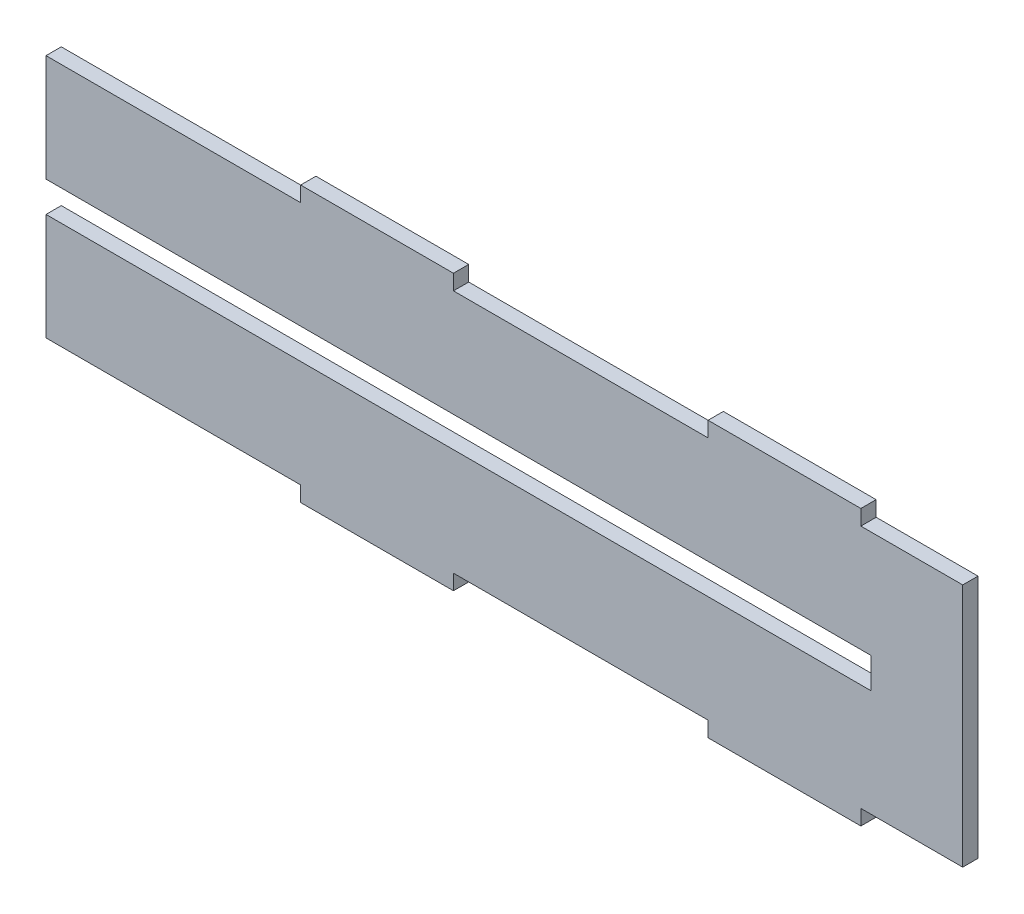
ISO-10303-21;
HEADER;
FILE_DESCRIPTION(('STEP AP214'),'2;1');
FILE_NAME('part.step','',(''),(''),'','','');
FILE_SCHEMA(('AUTOMOTIVE_DESIGN { 1 0 10303 214 1 1 1 1 }'));
ENDSEC;
DATA;
#1=APPLICATION_CONTEXT('core data for automotive mechanical design processes');
#2=APPLICATION_PROTOCOL_DEFINITION('international standard','automotive_design',2000,#1);
#3=PRODUCT_CONTEXT('',#1,'mechanical');
#4=PRODUCT('Part','Part','',(#3));
#5=PRODUCT_RELATED_PRODUCT_CATEGORY('part','',(#4));
#6=PRODUCT_DEFINITION_FORMATION('','',#4);
#7=PRODUCT_DEFINITION_CONTEXT('part definition',#1,'design');
#8=PRODUCT_DEFINITION('design','',#6,#7);
#9=PRODUCT_DEFINITION_SHAPE('','',#8);
#10=(LENGTH_UNIT() NAMED_UNIT(*) SI_UNIT(.MILLI.,.METRE.));
#11=(NAMED_UNIT(*) PLANE_ANGLE_UNIT() SI_UNIT($,.RADIAN.));
#12=(NAMED_UNIT(*) SI_UNIT($,.STERADIAN.) SOLID_ANGLE_UNIT());
#13=UNCERTAINTY_MEASURE_WITH_UNIT(LENGTH_MEASURE(1.E-05),#10,'distance_accuracy_value','');
#14=(GEOMETRIC_REPRESENTATION_CONTEXT(3) GLOBAL_UNCERTAINTY_ASSIGNED_CONTEXT((#13)) GLOBAL_UNIT_ASSIGNED_CONTEXT((#10,
#11,#12)) REPRESENTATION_CONTEXT('',''));
#15=CARTESIAN_POINT('',(0.,0.,0.));
#16=DIRECTION('',(0.,0.,1.));
#17=DIRECTION('',(1.,0.,0.));
#18=AXIS2_PLACEMENT_3D('',#15,#16,#17);
#19=CARTESIAN_POINT('',(180.,0.,3.));
#20=DIRECTION('',(1.,0.,0.));
#21=DIRECTION('',(0.,0.,-1.));
#22=AXIS2_PLACEMENT_3D('',#19,#20,#21);
#23=PLANE('',#22);
#24=DIRECTION('',(0.,-1.,0.));
#25=VECTOR('',#24,1.);
#26=CARTESIAN_POINT('',(180.,0.,0.));
#27=LINE('',#26,#25);
#28=CARTESIAN_POINT('',(180.,0.,0.));
#29=VERTEX_POINT('',#28);
#30=CARTESIAN_POINT('',(180.,-48.,0.));
#31=VERTEX_POINT('',#30);
#32=EDGE_CURVE('E222',#29,#31,#27,.T.);
#33=ORIENTED_EDGE('',*,*,#32,.F.);
#34=DIRECTION('',(0.,0.,-1.));
#35=VECTOR('',#34,1.);
#36=CARTESIAN_POINT('',(180.,0.,3.));
#37=LINE('',#36,#35);
#38=CARTESIAN_POINT('',(180.,0.,3.));
#39=VERTEX_POINT('',#38);
#40=EDGE_CURVE('E11',#39,#29,#37,.T.);
#41=ORIENTED_EDGE('',*,*,#40,.F.);
#42=DIRECTION('',(0.,-1.,0.));
#43=VECTOR('',#42,1.);
#44=CARTESIAN_POINT('',(180.,0.,3.));
#45=LINE('',#44,#43);
#46=CARTESIAN_POINT('',(180.,-48.,3.));
#47=VERTEX_POINT('',#46);
#48=EDGE_CURVE('E280',#39,#47,#45,.T.);
#49=ORIENTED_EDGE('',*,*,#48,.T.);
#50=DIRECTION('',(0.,0.,-1.));
#51=VECTOR('',#50,1.);
#52=CARTESIAN_POINT('',(180.,-48.,3.));
#53=LINE('',#52,#51);
#54=EDGE_CURVE('E133',#47,#31,#53,.T.);
#55=ORIENTED_EDGE('',*,*,#54,.T.);
#56=EDGE_LOOP('',(#33,#41,#49,#55));
#57=FACE_BOUND('',#56,.T.);
#58=ADVANCED_FACE('F34',(#57),#23,.T.);
#59=CARTESIAN_POINT('',(0.,0.,3.));
#60=DIRECTION('',(0.,1.,0.));
#61=DIRECTION('',(0.,0.,1.));
#62=AXIS2_PLACEMENT_3D('',#59,#60,#61);
#63=PLANE('',#62);
#64=DIRECTION('',(1.,0.,0.));
#65=VECTOR('',#64,1.);
#66=CARTESIAN_POINT('',(0.,0.,0.));
#67=LINE('',#66,#65);
#68=CARTESIAN_POINT('',(160.,0.,0.));
#69=VERTEX_POINT('',#68);
#70=EDGE_CURVE('E225',#69,#29,#67,.T.);
#71=ORIENTED_EDGE('',*,*,#70,.F.);
#72=DIRECTION('',(0.,0.,-1.));
#73=VECTOR('',#72,1.);
#74=CARTESIAN_POINT('',(160.,0.,3.));
#75=LINE('',#74,#73);
#76=CARTESIAN_POINT('',(160.,0.,3.));
#77=VERTEX_POINT('',#76);
#78=EDGE_CURVE('E42',#77,#69,#75,.T.);
#79=ORIENTED_EDGE('',*,*,#78,.F.);
#80=DIRECTION('',(1.,0.,0.));
#81=VECTOR('',#80,1.);
#82=CARTESIAN_POINT('',(0.,0.,3.));
#83=LINE('',#82,#81);
#84=EDGE_CURVE('E349',#77,#39,#83,.T.);
#85=ORIENTED_EDGE('',*,*,#84,.T.);
#86=ORIENTED_EDGE('',*,*,#40,.T.);
#87=EDGE_LOOP('',(#71,#79,#85,#86));
#88=FACE_BOUND('',#87,.T.);
#89=ADVANCED_FACE('F337',(#88),#63,.T.);
#90=CARTESIAN_POINT('',(160.,0.,3.));
#91=DIRECTION('',(1.,0.,0.));
#92=DIRECTION('',(0.,0.,-1.));
#93=AXIS2_PLACEMENT_3D('',#90,#91,#92);
#94=PLANE('',#93);
#95=DIRECTION('',(0.,-1.,0.));
#96=VECTOR('',#95,1.);
#97=CARTESIAN_POINT('',(160.,0.,0.));
#98=LINE('',#97,#96);
#99=CARTESIAN_POINT('',(160.,3.00000000000002,0.));
#100=VERTEX_POINT('',#99);
#101=EDGE_CURVE('E228',#100,#69,#98,.T.);
#102=ORIENTED_EDGE('',*,*,#101,.F.);
#103=DIRECTION('',(0.,0.,-1.));
#104=VECTOR('',#103,1.);
#105=CARTESIAN_POINT('',(160.,3.00000000000002,3.));
#106=LINE('',#105,#104);
#107=CARTESIAN_POINT('',(160.,3.00000000000002,3.));
#108=VERTEX_POINT('',#107);
#109=EDGE_CURVE('E326',#108,#100,#106,.T.);
#110=ORIENTED_EDGE('',*,*,#109,.F.);
#111=DIRECTION('',(0.,-1.,0.));
#112=VECTOR('',#111,1.);
#113=CARTESIAN_POINT('',(160.,0.,3.));
#114=LINE('',#113,#112);
#115=EDGE_CURVE('E333',#108,#77,#114,.T.);
#116=ORIENTED_EDGE('',*,*,#115,.T.);
#117=ORIENTED_EDGE('',*,*,#78,.T.);
#118=EDGE_LOOP('',(#102,#110,#116,#117));
#119=FACE_BOUND('',#118,.T.);
#120=ADVANCED_FACE('F331',(#119),#94,.T.);
#121=CARTESIAN_POINT('',(0.,2.99999999999998,3.));
#122=DIRECTION('',(0.,1.,0.));
#123=DIRECTION('',(-1.,0.,0.));
#124=AXIS2_PLACEMENT_3D('',#121,#122,#123);
#125=PLANE('',#124);
#126=DIRECTION('',(1.,0.,0.));
#127=VECTOR('',#126,1.);
#128=CARTESIAN_POINT('',(0.,2.99999999999998,0.));
#129=LINE('',#128,#127);
#130=CARTESIAN_POINT('',(130.,3.00000000000001,0.));
#131=VERTEX_POINT('',#130);
#132=EDGE_CURVE('E231',#131,#100,#129,.T.);
#133=ORIENTED_EDGE('',*,*,#132,.F.);
#134=DIRECTION('',(0.,0.,-1.));
#135=VECTOR('',#134,1.);
#136=CARTESIAN_POINT('',(130.,3.00000000000001,3.));
#137=LINE('',#136,#135);
#138=CARTESIAN_POINT('',(130.,3.00000000000001,3.));
#139=VERTEX_POINT('',#138);
#140=EDGE_CURVE('E324',#139,#131,#137,.T.);
#141=ORIENTED_EDGE('',*,*,#140,.F.);
#142=DIRECTION('',(1.,0.,0.));
#143=VECTOR('',#142,1.);
#144=CARTESIAN_POINT('',(0.,2.99999999999998,3.));
#145=LINE('',#144,#143);
#146=EDGE_CURVE('E346',#139,#108,#145,.T.);
#147=ORIENTED_EDGE('',*,*,#146,.T.);
#148=ORIENTED_EDGE('',*,*,#109,.T.);
#149=EDGE_LOOP('',(#133,#141,#147,#148));
#150=FACE_BOUND('',#149,.T.);
#151=ADVANCED_FACE('F343',(#150),#125,.T.);
#152=CARTESIAN_POINT('',(130.,0.,3.));
#153=DIRECTION('',(-1.,0.,0.));
#154=DIRECTION('',(0.,0.,1.));
#155=AXIS2_PLACEMENT_3D('',#152,#153,#154);
#156=PLANE('',#155);
#157=DIRECTION('',(0.,1.,0.));
#158=VECTOR('',#157,1.);
#159=CARTESIAN_POINT('',(130.,0.,0.));
#160=LINE('',#159,#158);
#161=CARTESIAN_POINT('',(130.,0.,0.));
#162=VERTEX_POINT('',#161);
#163=EDGE_CURVE('E234',#162,#131,#160,.T.);
#164=ORIENTED_EDGE('',*,*,#163,.F.);
#165=DIRECTION('',(0.,0.,-1.));
#166=VECTOR('',#165,1.);
#167=CARTESIAN_POINT('',(130.,0.,3.));
#168=LINE('',#167,#166);
#169=CARTESIAN_POINT('',(130.,0.,3.));
#170=VERTEX_POINT('',#169);
#171=EDGE_CURVE('E322',#170,#162,#168,.T.);
#172=ORIENTED_EDGE('',*,*,#171,.F.);
#173=DIRECTION('',(0.,1.,0.));
#174=VECTOR('',#173,1.);
#175=CARTESIAN_POINT('',(130.,0.,3.));
#176=LINE('',#175,#174);
#177=EDGE_CURVE('E351',#170,#139,#176,.T.);
#178=ORIENTED_EDGE('',*,*,#177,.T.);
#179=ORIENTED_EDGE('',*,*,#140,.T.);
#180=EDGE_LOOP('',(#164,#172,#178,#179));
#181=FACE_BOUND('',#180,.T.);
#182=ADVANCED_FACE('F416',(#181),#156,.T.);
#183=CARTESIAN_POINT('',(0.,0.,3.));
#184=DIRECTION('',(0.,1.,0.));
#185=DIRECTION('',(0.,0.,1.));
#186=AXIS2_PLACEMENT_3D('',#183,#184,#185);
#187=PLANE('',#186);
#188=DIRECTION('',(1.,0.,0.));
#189=VECTOR('',#188,1.);
#190=CARTESIAN_POINT('',(0.,0.,0.));
#191=LINE('',#190,#189);
#192=CARTESIAN_POINT('',(80.,0.,0.));
#193=VERTEX_POINT('',#192);
#194=EDGE_CURVE('E237',#193,#162,#191,.T.);
#195=ORIENTED_EDGE('',*,*,#194,.F.);
#196=DIRECTION('',(0.,0.,-1.));
#197=VECTOR('',#196,1.);
#198=CARTESIAN_POINT('',(80.,0.,3.));
#199=LINE('',#198,#197);
#200=CARTESIAN_POINT('',(80.,0.,3.));
#201=VERTEX_POINT('',#200);
#202=EDGE_CURVE('E320',#201,#193,#199,.T.);
#203=ORIENTED_EDGE('',*,*,#202,.F.);
#204=DIRECTION('',(1.,0.,0.));
#205=VECTOR('',#204,1.);
#206=CARTESIAN_POINT('',(0.,0.,3.));
#207=LINE('',#206,#205);
#208=EDGE_CURVE('E357',#201,#170,#207,.T.);
#209=ORIENTED_EDGE('',*,*,#208,.T.);
#210=ORIENTED_EDGE('',*,*,#171,.T.);
#211=EDGE_LOOP('',(#195,#203,#209,#210));
#212=FACE_BOUND('',#211,.T.);
#213=ADVANCED_FACE('F419',(#212),#187,.T.);
#214=CARTESIAN_POINT('',(80.,0.,3.));
#215=DIRECTION('',(1.,0.,0.));
#216=DIRECTION('',(0.,0.,-1.));
#217=AXIS2_PLACEMENT_3D('',#214,#215,#216);
#218=PLANE('',#217);
#219=DIRECTION('',(0.,-1.,0.));
#220=VECTOR('',#219,1.);
#221=CARTESIAN_POINT('',(80.,0.,0.));
#222=LINE('',#221,#220);
#223=CARTESIAN_POINT('',(80.,3.,0.));
#224=VERTEX_POINT('',#223);
#225=EDGE_CURVE('E240',#224,#193,#222,.T.);
#226=ORIENTED_EDGE('',*,*,#225,.F.);
#227=DIRECTION('',(0.,0.,-1.));
#228=VECTOR('',#227,1.);
#229=CARTESIAN_POINT('',(80.,3.,3.));
#230=LINE('',#229,#228);
#231=CARTESIAN_POINT('',(80.,3.,3.));
#232=VERTEX_POINT('',#231);
#233=EDGE_CURVE('E318',#232,#224,#230,.T.);
#234=ORIENTED_EDGE('',*,*,#233,.F.);
#235=DIRECTION('',(0.,-1.,0.));
#236=VECTOR('',#235,1.);
#237=CARTESIAN_POINT('',(80.,0.,3.));
#238=LINE('',#237,#236);
#239=EDGE_CURVE('E360',#232,#201,#238,.T.);
#240=ORIENTED_EDGE('',*,*,#239,.T.);
#241=ORIENTED_EDGE('',*,*,#202,.T.);
#242=EDGE_LOOP('',(#226,#234,#240,#241));
#243=FACE_BOUND('',#242,.T.);
#244=ADVANCED_FACE('F423',(#243),#218,.T.);
#245=CARTESIAN_POINT('',(0.,3.,3.));
#246=DIRECTION('',(0.,1.,0.));
#247=DIRECTION('',(0.,0.,1.));
#248=AXIS2_PLACEMENT_3D('',#245,#246,#247);
#249=PLANE('',#248);
#250=DIRECTION('',(1.,0.,0.));
#251=VECTOR('',#250,1.);
#252=CARTESIAN_POINT('',(0.,3.,0.));
#253=LINE('',#252,#251);
#254=CARTESIAN_POINT('',(50.,3.,0.));
#255=VERTEX_POINT('',#254);
#256=EDGE_CURVE('E243',#255,#224,#253,.T.);
#257=ORIENTED_EDGE('',*,*,#256,.F.);
#258=DIRECTION('',(0.,0.,-1.));
#259=VECTOR('',#258,1.);
#260=CARTESIAN_POINT('',(50.,3.,3.));
#261=LINE('',#260,#259);
#262=CARTESIAN_POINT('',(50.,3.,3.));
#263=VERTEX_POINT('',#262);
#264=EDGE_CURVE('E316',#263,#255,#261,.T.);
#265=ORIENTED_EDGE('',*,*,#264,.F.);
#266=DIRECTION('',(1.,0.,0.));
#267=VECTOR('',#266,1.);
#268=CARTESIAN_POINT('',(0.,3.,3.));
#269=LINE('',#268,#267);
#270=EDGE_CURVE('E363',#263,#232,#269,.T.);
#271=ORIENTED_EDGE('',*,*,#270,.T.);
#272=ORIENTED_EDGE('',*,*,#233,.T.);
#273=EDGE_LOOP('',(#257,#265,#271,#272));
#274=FACE_BOUND('',#273,.T.);
#275=ADVANCED_FACE('F427',(#274),#249,.T.);
#276=CARTESIAN_POINT('',(50.,0.,3.));
#277=DIRECTION('',(-1.,0.,0.));
#278=DIRECTION('',(0.,0.,1.));
#279=AXIS2_PLACEMENT_3D('',#276,#277,#278);
#280=PLANE('',#279);
#281=DIRECTION('',(0.,1.,0.));
#282=VECTOR('',#281,1.);
#283=CARTESIAN_POINT('',(50.,0.,0.));
#284=LINE('',#283,#282);
#285=CARTESIAN_POINT('',(50.,0.,0.));
#286=VERTEX_POINT('',#285);
#287=EDGE_CURVE('E246',#286,#255,#284,.T.);
#288=ORIENTED_EDGE('',*,*,#287,.F.);
#289=DIRECTION('',(0.,0.,-1.));
#290=VECTOR('',#289,1.);
#291=CARTESIAN_POINT('',(50.,0.,3.));
#292=LINE('',#291,#290);
#293=CARTESIAN_POINT('',(50.,0.,3.));
#294=VERTEX_POINT('',#293);
#295=EDGE_CURVE('E314',#294,#286,#292,.T.);
#296=ORIENTED_EDGE('',*,*,#295,.F.);
#297=DIRECTION('',(0.,1.,0.));
#298=VECTOR('',#297,1.);
#299=CARTESIAN_POINT('',(50.,0.,3.));
#300=LINE('',#299,#298);
#301=EDGE_CURVE('E366',#294,#263,#300,.T.);
#302=ORIENTED_EDGE('',*,*,#301,.T.);
#303=ORIENTED_EDGE('',*,*,#264,.T.);
#304=EDGE_LOOP('',(#288,#296,#302,#303));
#305=FACE_BOUND('',#304,.T.);
#306=ADVANCED_FACE('F431',(#305),#280,.T.);
#307=CARTESIAN_POINT('',(0.,0.,3.));
#308=DIRECTION('',(0.,1.,0.));
#309=DIRECTION('',(-1.,0.,0.));
#310=AXIS2_PLACEMENT_3D('',#307,#308,#309);
#311=PLANE('',#310);
#312=DIRECTION('',(1.,0.,0.));
#313=VECTOR('',#312,1.);
#314=CARTESIAN_POINT('',(0.,0.,0.));
#315=LINE('',#314,#313);
#316=CARTESIAN_POINT('',(0.,0.,0.));
#317=VERTEX_POINT('',#316);
#318=EDGE_CURVE('E249',#317,#286,#315,.T.);
#319=ORIENTED_EDGE('',*,*,#318,.F.);
#320=DIRECTION('',(0.,0.,-1.));
#321=VECTOR('',#320,1.);
#322=CARTESIAN_POINT('',(0.,0.,3.));
#323=LINE('',#322,#321);
#324=CARTESIAN_POINT('',(0.,0.,3.));
#325=VERTEX_POINT('',#324);
#326=EDGE_CURVE('E312',#325,#317,#323,.T.);
#327=ORIENTED_EDGE('',*,*,#326,.F.);
#328=DIRECTION('',(1.,0.,0.));
#329=VECTOR('',#328,1.);
#330=CARTESIAN_POINT('',(0.,0.,3.));
#331=LINE('',#330,#329);
#332=EDGE_CURVE('E369',#325,#294,#331,.T.);
#333=ORIENTED_EDGE('',*,*,#332,.T.);
#334=ORIENTED_EDGE('',*,*,#295,.T.);
#335=EDGE_LOOP('',(#319,#327,#333,#334));
#336=FACE_BOUND('',#335,.T.);
#337=ADVANCED_FACE('F435',(#336),#311,.T.);
#338=CARTESIAN_POINT('',(0.,0.,3.));
#339=DIRECTION('',(1.,0.,0.));
#340=DIRECTION('',(0.,1.,0.));
#341=AXIS2_PLACEMENT_3D('',#338,#339,#340);
#342=PLANE('',#341);
#343=DIRECTION('',(0.,-1.,0.));
#344=VECTOR('',#343,1.);
#345=CARTESIAN_POINT('',(0.,0.,0.));
#346=LINE('',#345,#344);
#347=CARTESIAN_POINT('',(0.,-21.,0.));
#348=VERTEX_POINT('',#347);
#349=EDGE_CURVE('E252',#317,#348,#346,.T.);
#350=ORIENTED_EDGE('',*,*,#349,.T.);
#351=DIRECTION('',(0.,0.,-1.));
#352=VECTOR('',#351,1.);
#353=CARTESIAN_POINT('',(0.,-21.,3.));
#354=LINE('',#353,#352);
#355=CARTESIAN_POINT('',(0.,-21.,3.));
#356=VERTEX_POINT('',#355);
#357=EDGE_CURVE('E309',#356,#348,#354,.T.);
#358=ORIENTED_EDGE('',*,*,#357,.F.);
#359=DIRECTION('',(0.,-1.,0.));
#360=VECTOR('',#359,1.);
#361=CARTESIAN_POINT('',(0.,0.,3.));
#362=LINE('',#361,#360);
#363=EDGE_CURVE('E372',#325,#356,#362,.T.);
#364=ORIENTED_EDGE('',*,*,#363,.F.);
#365=ORIENTED_EDGE('',*,*,#326,.T.);
#366=EDGE_LOOP('',(#350,#358,#364,#365));
#367=FACE_BOUND('',#366,.T.);
#368=ADVANCED_FACE('F439',(#367),#342,.F.);
#369=CARTESIAN_POINT('',(0.,-21.,3.));
#370=DIRECTION('',(0.,1.,0.));
#371=DIRECTION('',(-1.,0.,0.));
#372=AXIS2_PLACEMENT_3D('',#369,#370,#371);
#373=PLANE('',#372);
#374=DIRECTION('',(1.,0.,0.));
#375=VECTOR('',#374,1.);
#376=CARTESIAN_POINT('',(0.,-21.,0.));
#377=LINE('',#376,#375);
#378=CARTESIAN_POINT('',(162.,-21.,0.));
#379=VERTEX_POINT('',#378);
#380=EDGE_CURVE('E254',#348,#379,#377,.T.);
#381=ORIENTED_EDGE('',*,*,#380,.T.);
#382=DIRECTION('',(0.,0.,-1.));
#383=VECTOR('',#382,1.);
#384=CARTESIAN_POINT('',(162.,-21.,3.));
#385=LINE('',#384,#383);
#386=CARTESIAN_POINT('',(162.,-21.,3.));
#387=VERTEX_POINT('',#386);
#388=EDGE_CURVE('E306',#387,#379,#385,.T.);
#389=ORIENTED_EDGE('',*,*,#388,.F.);
#390=DIRECTION('',(1.,0.,0.));
#391=VECTOR('',#390,1.);
#392=CARTESIAN_POINT('',(0.,-21.,3.));
#393=LINE('',#392,#391);
#394=EDGE_CURVE('E374',#356,#387,#393,.T.);
#395=ORIENTED_EDGE('',*,*,#394,.F.);
#396=ORIENTED_EDGE('',*,*,#357,.T.);
#397=EDGE_LOOP('',(#381,#389,#395,#396));
#398=FACE_BOUND('',#397,.T.);
#399=ADVANCED_FACE('F443',(#398),#373,.F.);
#400=CARTESIAN_POINT('',(162.,0.,3.));
#401=DIRECTION('',(1.,0.,0.));
#402=DIRECTION('',(0.,0.,-1.));
#403=AXIS2_PLACEMENT_3D('',#400,#401,#402);
#404=PLANE('',#403);
#405=DIRECTION('',(0.,-1.,0.));
#406=VECTOR('',#405,1.);
#407=CARTESIAN_POINT('',(162.,0.,0.));
#408=LINE('',#407,#406);
#409=CARTESIAN_POINT('',(162.,-27.,0.));
#410=VERTEX_POINT('',#409);
#411=EDGE_CURVE('E256',#379,#410,#408,.T.);
#412=ORIENTED_EDGE('',*,*,#411,.T.);
#413=DIRECTION('',(0.,0.,-1.));
#414=VECTOR('',#413,1.);
#415=CARTESIAN_POINT('',(162.,-27.,3.));
#416=LINE('',#415,#414);
#417=CARTESIAN_POINT('',(162.,-27.,3.));
#418=VERTEX_POINT('',#417);
#419=EDGE_CURVE('E304',#418,#410,#416,.T.);
#420=ORIENTED_EDGE('',*,*,#419,.F.);
#421=DIRECTION('',(0.,-1.,0.));
#422=VECTOR('',#421,1.);
#423=CARTESIAN_POINT('',(162.,0.,3.));
#424=LINE('',#423,#422);
#425=EDGE_CURVE('E376',#387,#418,#424,.T.);
#426=ORIENTED_EDGE('',*,*,#425,.F.);
#427=ORIENTED_EDGE('',*,*,#388,.T.);
#428=EDGE_LOOP('',(#412,#420,#426,#427));
#429=FACE_BOUND('',#428,.T.);
#430=ADVANCED_FACE('F447',(#429),#404,.F.);
#431=CARTESIAN_POINT('',(0.,-27.,3.));
#432=DIRECTION('',(0.,1.,0.));
#433=DIRECTION('',(0.,0.,1.));
#434=AXIS2_PLACEMENT_3D('',#431,#432,#433);
#435=PLANE('',#434);
#436=DIRECTION('',(1.,0.,0.));
#437=VECTOR('',#436,1.);
#438=CARTESIAN_POINT('',(0.,-27.,0.));
#439=LINE('',#438,#437);
#440=CARTESIAN_POINT('',(0.,-27.,0.));
#441=VERTEX_POINT('',#440);
#442=EDGE_CURVE('E259',#441,#410,#439,.T.);
#443=ORIENTED_EDGE('',*,*,#442,.F.);
#444=DIRECTION('',(0.,0.,-1.));
#445=VECTOR('',#444,1.);
#446=CARTESIAN_POINT('',(0.,-27.,3.));
#447=LINE('',#446,#445);
#448=CARTESIAN_POINT('',(0.,-27.,3.));
#449=VERTEX_POINT('',#448);
#450=EDGE_CURVE('E302',#449,#441,#447,.T.);
#451=ORIENTED_EDGE('',*,*,#450,.F.);
#452=DIRECTION('',(1.,0.,0.));
#453=VECTOR('',#452,1.);
#454=CARTESIAN_POINT('',(0.,-27.,3.));
#455=LINE('',#454,#453);
#456=EDGE_CURVE('E378',#449,#418,#455,.T.);
#457=ORIENTED_EDGE('',*,*,#456,.T.);
#458=ORIENTED_EDGE('',*,*,#419,.T.);
#459=EDGE_LOOP('',(#443,#451,#457,#458));
#460=FACE_BOUND('',#459,.T.);
#461=ADVANCED_FACE('F451',(#460),#435,.T.);
#462=CARTESIAN_POINT('',(0.,0.,3.));
#463=DIRECTION('',(1.,0.,0.));
#464=DIRECTION('',(0.,1.,0.));
#465=AXIS2_PLACEMENT_3D('',#462,#463,#464);
#466=PLANE('',#465);
#467=DIRECTION('',(0.,-1.,0.));
#468=VECTOR('',#467,1.);
#469=CARTESIAN_POINT('',(0.,0.,0.));
#470=LINE('',#469,#468);
#471=CARTESIAN_POINT('',(0.,-48.,0.));
#472=VERTEX_POINT('',#471);
#473=EDGE_CURVE('E262',#441,#472,#470,.T.);
#474=ORIENTED_EDGE('',*,*,#473,.T.);
#475=DIRECTION('',(0.,0.,-1.));
#476=VECTOR('',#475,1.);
#477=CARTESIAN_POINT('',(0.,-48.,3.));
#478=LINE('',#477,#476);
#479=CARTESIAN_POINT('',(0.,-48.,3.));
#480=VERTEX_POINT('',#479);
#481=EDGE_CURVE('E299',#480,#472,#478,.T.);
#482=ORIENTED_EDGE('',*,*,#481,.F.);
#483=DIRECTION('',(0.,-1.,0.));
#484=VECTOR('',#483,1.);
#485=CARTESIAN_POINT('',(0.,0.,3.));
#486=LINE('',#485,#484);
#487=EDGE_CURVE('E381',#449,#480,#486,.T.);
#488=ORIENTED_EDGE('',*,*,#487,.F.);
#489=ORIENTED_EDGE('',*,*,#450,.T.);
#490=EDGE_LOOP('',(#474,#482,#488,#489));
#491=FACE_BOUND('',#490,.T.);
#492=ADVANCED_FACE('F455',(#491),#466,.F.);
#493=CARTESIAN_POINT('',(0.,-48.,3.));
#494=DIRECTION('',(0.,1.,0.));
#495=DIRECTION('',(-1.,0.,0.));
#496=AXIS2_PLACEMENT_3D('',#493,#494,#495);
#497=PLANE('',#496);
#498=DIRECTION('',(1.,0.,0.));
#499=VECTOR('',#498,1.);
#500=CARTESIAN_POINT('',(0.,-48.,0.));
#501=LINE('',#500,#499);
#502=CARTESIAN_POINT('',(50.,-48.,0.));
#503=VERTEX_POINT('',#502);
#504=EDGE_CURVE('E264',#472,#503,#501,.T.);
#505=ORIENTED_EDGE('',*,*,#504,.T.);
#506=DIRECTION('',(0.,0.,-1.));
#507=VECTOR('',#506,1.);
#508=CARTESIAN_POINT('',(50.,-48.,3.));
#509=LINE('',#508,#507);
#510=CARTESIAN_POINT('',(50.,-48.,3.));
#511=VERTEX_POINT('',#510);
#512=EDGE_CURVE('E296',#511,#503,#509,.T.);
#513=ORIENTED_EDGE('',*,*,#512,.F.);
#514=DIRECTION('',(1.,0.,0.));
#515=VECTOR('',#514,1.);
#516=CARTESIAN_POINT('',(0.,-48.,3.));
#517=LINE('',#516,#515);
#518=EDGE_CURVE('E383',#480,#511,#517,.T.);
#519=ORIENTED_EDGE('',*,*,#518,.F.);
#520=ORIENTED_EDGE('',*,*,#481,.T.);
#521=EDGE_LOOP('',(#505,#513,#519,#520));
#522=FACE_BOUND('',#521,.T.);
#523=ADVANCED_FACE('F459',(#522),#497,.F.);
#524=CARTESIAN_POINT('',(50.,0.,3.));
#525=DIRECTION('',(1.,0.,0.));
#526=DIRECTION('',(0.,0.,-1.));
#527=AXIS2_PLACEMENT_3D('',#524,#525,#526);
#528=PLANE('',#527);
#529=DIRECTION('',(0.,-1.,0.));
#530=VECTOR('',#529,1.);
#531=CARTESIAN_POINT('',(50.,0.,0.));
#532=LINE('',#531,#530);
#533=CARTESIAN_POINT('',(50.,-51.,0.));
#534=VERTEX_POINT('',#533);
#535=EDGE_CURVE('E266',#503,#534,#532,.T.);
#536=ORIENTED_EDGE('',*,*,#535,.T.);
#537=DIRECTION('',(0.,0.,-1.));
#538=VECTOR('',#537,1.);
#539=CARTESIAN_POINT('',(50.,-51.,3.));
#540=LINE('',#539,#538);
#541=CARTESIAN_POINT('',(50.,-51.,3.));
#542=VERTEX_POINT('',#541);
#543=EDGE_CURVE('E293',#542,#534,#540,.T.);
#544=ORIENTED_EDGE('',*,*,#543,.F.);
#545=DIRECTION('',(0.,-1.,0.));
#546=VECTOR('',#545,1.);
#547=CARTESIAN_POINT('',(50.,0.,3.));
#548=LINE('',#547,#546);
#549=EDGE_CURVE('E385',#511,#542,#548,.T.);
#550=ORIENTED_EDGE('',*,*,#549,.F.);
#551=ORIENTED_EDGE('',*,*,#512,.T.);
#552=EDGE_LOOP('',(#536,#544,#550,#551));
#553=FACE_BOUND('',#552,.T.);
#554=ADVANCED_FACE('F463',(#553),#528,.F.);
#555=CARTESIAN_POINT('',(0.,-51.,3.));
#556=DIRECTION('',(0.,1.,0.));
#557=DIRECTION('',(0.,0.,1.));
#558=AXIS2_PLACEMENT_3D('',#555,#556,#557);
#559=PLANE('',#558);
#560=DIRECTION('',(1.,0.,0.));
#561=VECTOR('',#560,1.);
#562=CARTESIAN_POINT('',(0.,-51.,0.));
#563=LINE('',#562,#561);
#564=CARTESIAN_POINT('',(80.,-51.,0.));
#565=VERTEX_POINT('',#564);
#566=EDGE_CURVE('E268',#534,#565,#563,.T.);
#567=ORIENTED_EDGE('',*,*,#566,.T.);
#568=DIRECTION('',(0.,0.,-1.));
#569=VECTOR('',#568,1.);
#570=CARTESIAN_POINT('',(80.,-51.,3.));
#571=LINE('',#570,#569);
#572=CARTESIAN_POINT('',(80.,-51.,3.));
#573=VERTEX_POINT('',#572);
#574=EDGE_CURVE('E290',#573,#565,#571,.T.);
#575=ORIENTED_EDGE('',*,*,#574,.F.);
#576=DIRECTION('',(1.,0.,0.));
#577=VECTOR('',#576,1.);
#578=CARTESIAN_POINT('',(0.,-51.,3.));
#579=LINE('',#578,#577);
#580=EDGE_CURVE('E387',#542,#573,#579,.T.);
#581=ORIENTED_EDGE('',*,*,#580,.F.);
#582=ORIENTED_EDGE('',*,*,#543,.T.);
#583=EDGE_LOOP('',(#567,#575,#581,#582));
#584=FACE_BOUND('',#583,.T.);
#585=ADVANCED_FACE('F467',(#584),#559,.F.);
#586=CARTESIAN_POINT('',(80.,0.,3.));
#587=DIRECTION('',(-1.,0.,0.));
#588=DIRECTION('',(0.,0.,1.));
#589=AXIS2_PLACEMENT_3D('',#586,#587,#588);
#590=PLANE('',#589);
#591=DIRECTION('',(0.,1.,0.));
#592=VECTOR('',#591,1.);
#593=CARTESIAN_POINT('',(80.,0.,0.));
#594=LINE('',#593,#592);
#595=CARTESIAN_POINT('',(80.,-48.,0.));
#596=VERTEX_POINT('',#595);
#597=EDGE_CURVE('E270',#565,#596,#594,.T.);
#598=ORIENTED_EDGE('',*,*,#597,.T.);
#599=DIRECTION('',(0.,0.,-1.));
#600=VECTOR('',#599,1.);
#601=CARTESIAN_POINT('',(80.,-48.,3.));
#602=LINE('',#601,#600);
#603=CARTESIAN_POINT('',(80.,-48.,3.));
#604=VERTEX_POINT('',#603);
#605=EDGE_CURVE('E287',#604,#596,#602,.T.);
#606=ORIENTED_EDGE('',*,*,#605,.F.);
#607=DIRECTION('',(0.,1.,0.));
#608=VECTOR('',#607,1.);
#609=CARTESIAN_POINT('',(80.,0.,3.));
#610=LINE('',#609,#608);
#611=EDGE_CURVE('E389',#573,#604,#610,.T.);
#612=ORIENTED_EDGE('',*,*,#611,.F.);
#613=ORIENTED_EDGE('',*,*,#574,.T.);
#614=EDGE_LOOP('',(#598,#606,#612,#613));
#615=FACE_BOUND('',#614,.T.);
#616=ADVANCED_FACE('F471',(#615),#590,.F.);
#617=CARTESIAN_POINT('',(0.,-48.,3.));
#618=DIRECTION('',(0.,1.,0.));
#619=DIRECTION('',(0.,0.,1.));
#620=AXIS2_PLACEMENT_3D('',#617,#618,#619);
#621=PLANE('',#620);
#622=DIRECTION('',(1.,0.,0.));
#623=VECTOR('',#622,1.);
#624=CARTESIAN_POINT('',(0.,-48.,0.));
#625=LINE('',#624,#623);
#626=CARTESIAN_POINT('',(130.,-48.,0.));
#627=VERTEX_POINT('',#626);
#628=EDGE_CURVE('E272',#596,#627,#625,.T.);
#629=ORIENTED_EDGE('',*,*,#628,.T.);
#630=DIRECTION('',(0.,0.,-1.));
#631=VECTOR('',#630,1.);
#632=CARTESIAN_POINT('',(130.,-48.,3.));
#633=LINE('',#632,#631);
#634=CARTESIAN_POINT('',(130.,-48.,3.));
#635=VERTEX_POINT('',#634);
#636=EDGE_CURVE('E284',#635,#627,#633,.T.);
#637=ORIENTED_EDGE('',*,*,#636,.F.);
#638=DIRECTION('',(1.,0.,0.));
#639=VECTOR('',#638,1.);
#640=CARTESIAN_POINT('',(0.,-48.,3.));
#641=LINE('',#640,#639);
#642=EDGE_CURVE('E391',#604,#635,#641,.T.);
#643=ORIENTED_EDGE('',*,*,#642,.F.);
#644=ORIENTED_EDGE('',*,*,#605,.T.);
#645=EDGE_LOOP('',(#629,#637,#643,#644));
#646=FACE_BOUND('',#645,.T.);
#647=ADVANCED_FACE('F397',(#646),#621,.F.);
#648=CARTESIAN_POINT('',(130.,0.,3.));
#649=DIRECTION('',(1.,0.,0.));
#650=DIRECTION('',(0.,0.,-1.));
#651=AXIS2_PLACEMENT_3D('',#648,#649,#650);
#652=PLANE('',#651);
#653=DIRECTION('',(0.,-1.,0.));
#654=VECTOR('',#653,1.);
#655=CARTESIAN_POINT('',(130.,0.,0.));
#656=LINE('',#655,#654);
#657=CARTESIAN_POINT('',(130.,-51.,0.));
#658=VERTEX_POINT('',#657);
#659=EDGE_CURVE('E274',#627,#658,#656,.T.);
#660=ORIENTED_EDGE('',*,*,#659,.T.);
#661=DIRECTION('',(0.,0.,-1.));
#662=VECTOR('',#661,1.);
#663=CARTESIAN_POINT('',(130.,-51.,3.));
#664=LINE('',#663,#662);
#665=CARTESIAN_POINT('',(130.,-51.,3.));
#666=VERTEX_POINT('',#665);
#667=EDGE_CURVE('E214',#666,#658,#664,.T.);
#668=ORIENTED_EDGE('',*,*,#667,.F.);
#669=DIRECTION('',(0.,-1.,0.));
#670=VECTOR('',#669,1.);
#671=CARTESIAN_POINT('',(130.,0.,3.));
#672=LINE('',#671,#670);
#673=EDGE_CURVE('E205',#635,#666,#672,.T.);
#674=ORIENTED_EDGE('',*,*,#673,.F.);
#675=ORIENTED_EDGE('',*,*,#636,.T.);
#676=EDGE_LOOP('',(#660,#668,#674,#675));
#677=FACE_BOUND('',#676,.T.);
#678=ADVANCED_FACE('F401',(#677),#652,.F.);
#679=CARTESIAN_POINT('',(0.,-51.,3.));
#680=DIRECTION('',(0.,1.,0.));
#681=DIRECTION('',(0.,0.,1.));
#682=AXIS2_PLACEMENT_3D('',#679,#680,#681);
#683=PLANE('',#682);
#684=DIRECTION('',(1.,0.,0.));
#685=VECTOR('',#684,1.);
#686=CARTESIAN_POINT('',(0.,-51.,0.));
#687=LINE('',#686,#685);
#688=CARTESIAN_POINT('',(160.,-51.,0.));
#689=VERTEX_POINT('',#688);
#690=EDGE_CURVE('E213',#658,#689,#687,.T.);
#691=ORIENTED_EDGE('',*,*,#690,.T.);
#692=DIRECTION('',(0.,0.,-1.));
#693=VECTOR('',#692,1.);
#694=CARTESIAN_POINT('',(160.,-51.,3.));
#695=LINE('',#694,#693);
#696=CARTESIAN_POINT('',(160.,-51.,3.));
#697=VERTEX_POINT('',#696);
#698=EDGE_CURVE('E210',#697,#689,#695,.T.);
#699=ORIENTED_EDGE('',*,*,#698,.F.);
#700=DIRECTION('',(1.,0.,0.));
#701=VECTOR('',#700,1.);
#702=CARTESIAN_POINT('',(0.,-51.,3.));
#703=LINE('',#702,#701);
#704=EDGE_CURVE('E199',#666,#697,#703,.T.);
#705=ORIENTED_EDGE('',*,*,#704,.F.);
#706=ORIENTED_EDGE('',*,*,#667,.T.);
#707=EDGE_LOOP('',(#691,#699,#705,#706));
#708=FACE_BOUND('',#707,.T.);
#709=ADVANCED_FACE('F211',(#708),#683,.F.);
#710=CARTESIAN_POINT('',(160.,0.,3.));
#711=DIRECTION('',(-1.,0.,0.));
#712=DIRECTION('',(0.,0.,1.));
#713=AXIS2_PLACEMENT_3D('',#710,#711,#712);
#714=PLANE('',#713);
#715=DIRECTION('',(0.,1.,0.));
#716=VECTOR('',#715,1.);
#717=CARTESIAN_POINT('',(160.,0.,0.));
#718=LINE('',#717,#716);
#719=CARTESIAN_POINT('',(160.,-48.,0.));
#720=VERTEX_POINT('',#719);
#721=EDGE_CURVE('E126',#689,#720,#718,.T.);
#722=ORIENTED_EDGE('',*,*,#721,.T.);
#723=DIRECTION('',(0.,0.,-1.));
#724=VECTOR('',#723,1.);
#725=CARTESIAN_POINT('',(160.,-48.,3.));
#726=LINE('',#725,#724);
#727=CARTESIAN_POINT('',(160.,-48.,3.));
#728=VERTEX_POINT('',#727);
#729=EDGE_CURVE('E215',#728,#720,#726,.T.);
#730=ORIENTED_EDGE('',*,*,#729,.F.);
#731=DIRECTION('',(0.,1.,0.));
#732=VECTOR('',#731,1.);
#733=CARTESIAN_POINT('',(160.,0.,3.));
#734=LINE('',#733,#732);
#735=EDGE_CURVE('E203',#697,#728,#734,.T.);
#736=ORIENTED_EDGE('',*,*,#735,.F.);
#737=ORIENTED_EDGE('',*,*,#698,.T.);
#738=EDGE_LOOP('',(#722,#730,#736,#737));
#739=FACE_BOUND('',#738,.T.);
#740=ADVANCED_FACE('F217',(#739),#714,.F.);
#741=CARTESIAN_POINT('',(0.,-48.,3.));
#742=DIRECTION('',(0.,1.,0.));
#743=DIRECTION('',(0.,0.,1.));
#744=AXIS2_PLACEMENT_3D('',#741,#742,#743);
#745=PLANE('',#744);
#746=DIRECTION('',(1.,0.,0.));
#747=VECTOR('',#746,1.);
#748=CARTESIAN_POINT('',(0.,-48.,0.));
#749=LINE('',#748,#747);
#750=EDGE_CURVE('E278',#720,#31,#749,.T.);
#751=ORIENTED_EDGE('',*,*,#750,.T.);
#752=ORIENTED_EDGE('',*,*,#54,.F.);
#753=DIRECTION('',(1.,0.,0.));
#754=VECTOR('',#753,1.);
#755=CARTESIAN_POINT('',(0.,-48.,3.));
#756=LINE('',#755,#754);
#757=EDGE_CURVE('E50',#728,#47,#756,.T.);
#758=ORIENTED_EDGE('',*,*,#757,.F.);
#759=ORIENTED_EDGE('',*,*,#729,.T.);
#760=EDGE_LOOP('',(#751,#752,#758,#759));
#761=FACE_BOUND('',#760,.T.);
#762=ADVANCED_FACE('F404',(#761),#745,.F.);
#763=CARTESIAN_POINT('',(0.,0.,3.));
#764=DIRECTION('',(0.,0.,1.));
#765=DIRECTION('',(1.,0.,0.));
#766=AXIS2_PLACEMENT_3D('',#763,#764,#765);
#767=PLANE('',#766);
#768=ORIENTED_EDGE('',*,*,#48,.F.);
#769=ORIENTED_EDGE('',*,*,#84,.F.);
#770=ORIENTED_EDGE('',*,*,#115,.F.);
#771=ORIENTED_EDGE('',*,*,#146,.F.);
#772=ORIENTED_EDGE('',*,*,#177,.F.);
#773=ORIENTED_EDGE('',*,*,#208,.F.);
#774=ORIENTED_EDGE('',*,*,#239,.F.);
#775=ORIENTED_EDGE('',*,*,#270,.F.);
#776=ORIENTED_EDGE('',*,*,#301,.F.);
#777=ORIENTED_EDGE('',*,*,#332,.F.);
#778=ORIENTED_EDGE('',*,*,#363,.T.);
#779=ORIENTED_EDGE('',*,*,#394,.T.);
#780=ORIENTED_EDGE('',*,*,#425,.T.);
#781=ORIENTED_EDGE('',*,*,#456,.F.);
#782=ORIENTED_EDGE('',*,*,#487,.T.);
#783=ORIENTED_EDGE('',*,*,#518,.T.);
#784=ORIENTED_EDGE('',*,*,#549,.T.);
#785=ORIENTED_EDGE('',*,*,#580,.T.);
#786=ORIENTED_EDGE('',*,*,#611,.T.);
#787=ORIENTED_EDGE('',*,*,#642,.T.);
#788=ORIENTED_EDGE('',*,*,#673,.T.);
#789=ORIENTED_EDGE('',*,*,#704,.T.);
#790=ORIENTED_EDGE('',*,*,#735,.T.);
#791=ORIENTED_EDGE('',*,*,#757,.T.);
#792=EDGE_LOOP('',(#768,#769,#770,#771,#772,#773,#774,#775,#776,#777,#778,#779,#780,#781,#782,
#783,#784,#785,#786,#787,#788,#789,#790,#791));
#793=FACE_BOUND('',#792,.T.);
#794=ADVANCED_FACE('F201',(#793),#767,.T.);
#795=CARTESIAN_POINT('',(0.,0.,0.));
#796=DIRECTION('',(0.,0.,1.));
#797=DIRECTION('',(1.,0.,0.));
#798=AXIS2_PLACEMENT_3D('',#795,#796,#797);
#799=PLANE('',#798);
#800=ORIENTED_EDGE('',*,*,#32,.T.);
#801=ORIENTED_EDGE('',*,*,#750,.F.);
#802=ORIENTED_EDGE('',*,*,#721,.F.);
#803=ORIENTED_EDGE('',*,*,#690,.F.);
#804=ORIENTED_EDGE('',*,*,#659,.F.);
#805=ORIENTED_EDGE('',*,*,#628,.F.);
#806=ORIENTED_EDGE('',*,*,#597,.F.);
#807=ORIENTED_EDGE('',*,*,#566,.F.);
#808=ORIENTED_EDGE('',*,*,#535,.F.);
#809=ORIENTED_EDGE('',*,*,#504,.F.);
#810=ORIENTED_EDGE('',*,*,#473,.F.);
#811=ORIENTED_EDGE('',*,*,#442,.T.);
#812=ORIENTED_EDGE('',*,*,#411,.F.);
#813=ORIENTED_EDGE('',*,*,#380,.F.);
#814=ORIENTED_EDGE('',*,*,#349,.F.);
#815=ORIENTED_EDGE('',*,*,#318,.T.);
#816=ORIENTED_EDGE('',*,*,#287,.T.);
#817=ORIENTED_EDGE('',*,*,#256,.T.);
#818=ORIENTED_EDGE('',*,*,#225,.T.);
#819=ORIENTED_EDGE('',*,*,#194,.T.);
#820=ORIENTED_EDGE('',*,*,#163,.T.);
#821=ORIENTED_EDGE('',*,*,#132,.T.);
#822=ORIENTED_EDGE('',*,*,#101,.T.);
#823=ORIENTED_EDGE('',*,*,#70,.T.);
#824=EDGE_LOOP('',(#800,#801,#802,#803,#804,#805,#806,#807,#808,#809,#810,#811,#812,#813,#814,
#815,#816,#817,#818,#819,#820,#821,#822,#823));
#825=FACE_BOUND('',#824,.T.);
#826=ADVANCED_FACE('F339',(#825),#799,.F.);
#827=CLOSED_SHELL('',(#58,#89,#120,#151,#182,#213,#244,#275,#306,#337,#368,#399,#430,#461,#492,
#523,#554,#585,#616,#647,#678,#709,#740,#762,#794,#826));
#828=MANIFOLD_SOLID_BREP('B2',#827);
#829=ADVANCED_BREP_SHAPE_REPRESENTATION('',(#18,#828),#14);
#830=SHAPE_DEFINITION_REPRESENTATION(#9,#829);
ENDSEC;
END-ISO-10303-21;
